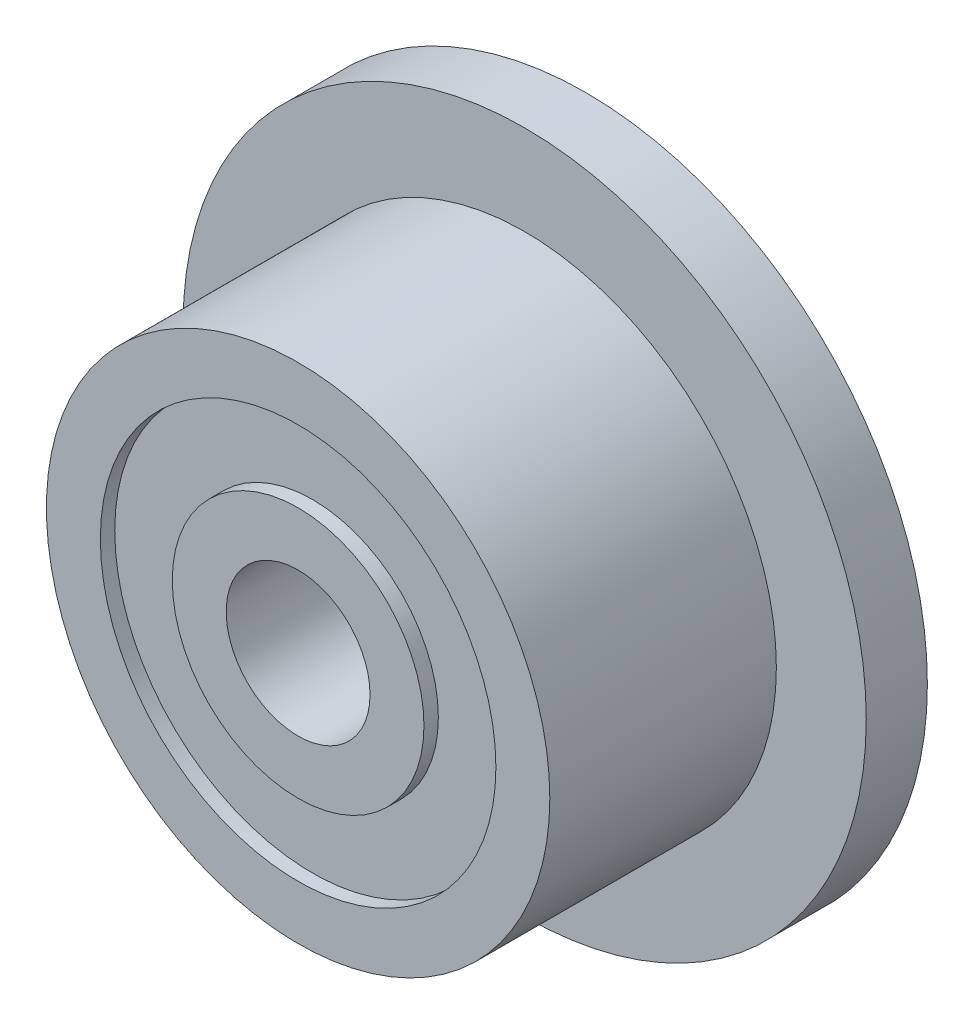
ISO-10303-21;
HEADER;
FILE_DESCRIPTION(('STEP AP214'),'2;1');
FILE_NAME('part.step','',(''),(''),'','','');
FILE_SCHEMA(('AUTOMOTIVE_DESIGN { 1 0 10303 214 1 1 1 1 }'));
ENDSEC;
DATA;
#1=APPLICATION_CONTEXT('core data for automotive mechanical design processes');
#2=APPLICATION_PROTOCOL_DEFINITION('international standard','automotive_design',2000,#1);
#3=PRODUCT_CONTEXT('',#1,'mechanical');
#4=PRODUCT('Part','Part','',(#3));
#5=PRODUCT_RELATED_PRODUCT_CATEGORY('part','',(#4));
#6=PRODUCT_DEFINITION_FORMATION('','',#4);
#7=PRODUCT_DEFINITION_CONTEXT('part definition',#1,'design');
#8=PRODUCT_DEFINITION('design','',#6,#7);
#9=PRODUCT_DEFINITION_SHAPE('','',#8);
#10=(LENGTH_UNIT() NAMED_UNIT(*) SI_UNIT(.MILLI.,.METRE.));
#11=(NAMED_UNIT(*) PLANE_ANGLE_UNIT() SI_UNIT($,.RADIAN.));
#12=(NAMED_UNIT(*) SI_UNIT($,.STERADIAN.) SOLID_ANGLE_UNIT());
#13=UNCERTAINTY_MEASURE_WITH_UNIT(LENGTH_MEASURE(1.E-05),#10,'distance_accuracy_value','');
#14=(GEOMETRIC_REPRESENTATION_CONTEXT(3) GLOBAL_UNCERTAINTY_ASSIGNED_CONTEXT((#13)) GLOBAL_UNIT_ASSIGNED_CONTEXT((#10,
#11,#12)) REPRESENTATION_CONTEXT('',''));
#15=CARTESIAN_POINT('',(0.,0.,0.));
#16=DIRECTION('',(0.,0.,1.));
#17=DIRECTION('',(1.,0.,0.));
#18=AXIS2_PLACEMENT_3D('',#15,#16,#17);
#19=CARTESIAN_POINT('',(0.,0.,0.));
#20=DIRECTION('',(0.,0.,1.));
#21=DIRECTION('',(1.,0.,0.));
#22=AXIS2_PLACEMENT_3D('',#19,#20,#21);
#23=PLANE('',#22);
#24=CARTESIAN_POINT('',(0.,0.,0.));
#25=DIRECTION('',(0.,0.,1.));
#26=DIRECTION('',(1.,0.,0.));
#27=AXIS2_PLACEMENT_3D('',#24,#25,#26);
#28=CIRCLE('',#27,1.);
#29=CARTESIAN_POINT('',(1.,0.,0.));
#30=VERTEX_POINT('',#29);
#31=EDGE_CURVE('E47',#30,#30,#28,.T.);
#32=ORIENTED_EDGE('',*,*,#31,.T.);
#33=EDGE_LOOP('',(#32));
#34=FACE_BOUND('',#33,.T.);
#35=CARTESIAN_POINT('',(0.,0.,0.));
#36=DIRECTION('',(0.,0.,-1.));
#37=DIRECTION('',(-1.,0.,0.));
#38=AXIS2_PLACEMENT_3D('',#35,#36,#37);
#39=CIRCLE('',#38,1.75);
#40=CARTESIAN_POINT('',(-1.75,0.,0.));
#41=VERTEX_POINT('',#40);
#42=EDGE_CURVE('E72',#41,#41,#39,.T.);
#43=ORIENTED_EDGE('',*,*,#42,.T.);
#44=EDGE_LOOP('',(#43));
#45=FACE_BOUND('',#44,.T.);
#46=ADVANCED_FACE('F30',(#34,#45),#23,.F.);
#47=CARTESIAN_POINT('',(0.,0.,4.));
#48=DIRECTION('',(0.,0.,1.));
#49=DIRECTION('',(1.,0.,0.));
#50=AXIS2_PLACEMENT_3D('',#47,#48,#49);
#51=PLANE('',#50);
#52=CARTESIAN_POINT('',(0.,0.,4.));
#53=DIRECTION('',(0.,0.,1.));
#54=DIRECTION('',(1.,0.,0.));
#55=AXIS2_PLACEMENT_3D('',#52,#53,#54);
#56=CIRCLE('',#55,1.);
#57=CARTESIAN_POINT('',(1.,0.,4.));
#58=VERTEX_POINT('',#57);
#59=EDGE_CURVE('E48',#58,#58,#56,.T.);
#60=ORIENTED_EDGE('',*,*,#59,.F.);
#61=EDGE_LOOP('',(#60));
#62=FACE_BOUND('',#61,.T.);
#63=CARTESIAN_POINT('',(0.,0.,4.));
#64=DIRECTION('',(0.,0.,1.));
#65=DIRECTION('',(1.,0.,0.));
#66=AXIS2_PLACEMENT_3D('',#63,#64,#65);
#67=CIRCLE('',#66,1.75);
#68=CARTESIAN_POINT('',(1.75,0.,4.));
#69=VERTEX_POINT('',#68);
#70=EDGE_CURVE('E60',#69,#69,#67,.T.);
#71=ORIENTED_EDGE('',*,*,#70,.T.);
#72=EDGE_LOOP('',(#71));
#73=FACE_BOUND('',#72,.T.);
#74=ADVANCED_FACE('F103',(#62,#73),#51,.T.);
#75=CARTESIAN_POINT('',(0.,0.,0.85));
#76=DIRECTION('',(0.,0.,-1.));
#77=DIRECTION('',(-1.,0.,0.));
#78=AXIS2_PLACEMENT_3D('',#75,#76,#77);
#79=CYLINDRICAL_SURFACE('',#78,4.75);
#80=CARTESIAN_POINT('',(0.,0.,0.85));
#81=DIRECTION('',(0.,0.,1.));
#82=DIRECTION('',(1.,0.,0.));
#83=AXIS2_PLACEMENT_3D('',#80,#81,#82);
#84=CIRCLE('',#83,4.75);
#85=CARTESIAN_POINT('',(4.75,0.,0.85));
#86=VERTEX_POINT('',#85);
#87=EDGE_CURVE('E38',#86,#86,#84,.T.);
#88=ORIENTED_EDGE('',*,*,#87,.F.);
#89=EDGE_LOOP('',(#88));
#90=FACE_BOUND('',#89,.T.);
#91=CARTESIAN_POINT('',(0.,0.,0.));
#92=DIRECTION('',(0.,0.,1.));
#93=DIRECTION('',(1.,0.,0.));
#94=AXIS2_PLACEMENT_3D('',#91,#92,#93);
#95=CIRCLE('',#94,4.75);
#96=CARTESIAN_POINT('',(4.75,0.,0.));
#97=VERTEX_POINT('',#96);
#98=EDGE_CURVE('E34',#97,#97,#95,.T.);
#99=ORIENTED_EDGE('',*,*,#98,.T.);
#100=EDGE_LOOP('',(#99));
#101=FACE_BOUND('',#100,.T.);
#102=ADVANCED_FACE('F32',(#90,#101),#79,.T.);
#103=CARTESIAN_POINT('',(0.,0.,0.85));
#104=DIRECTION('',(0.,0.,1.));
#105=DIRECTION('',(1.,0.,0.));
#106=AXIS2_PLACEMENT_3D('',#103,#104,#105);
#107=PLANE('',#106);
#108=CARTESIAN_POINT('',(0.,0.,0.85));
#109=DIRECTION('',(0.,0.,1.));
#110=DIRECTION('',(1.,0.,0.));
#111=AXIS2_PLACEMENT_3D('',#108,#109,#110);
#112=CIRCLE('',#111,3.5);
#113=CARTESIAN_POINT('',(3.5,0.,0.85));
#114=VERTEX_POINT('',#113);
#115=EDGE_CURVE('E10',#114,#114,#112,.T.);
#116=ORIENTED_EDGE('',*,*,#115,.F.);
#117=EDGE_LOOP('',(#116));
#118=FACE_BOUND('',#117,.T.);
#119=ORIENTED_EDGE('',*,*,#87,.T.);
#120=EDGE_LOOP('',(#119));
#121=FACE_BOUND('',#120,.T.);
#122=ADVANCED_FACE('F98',(#118,#121),#107,.T.);
#123=CARTESIAN_POINT('',(0.,0.,0.));
#124=DIRECTION('',(0.,0.,-1.));
#125=DIRECTION('',(-1.,0.,0.));
#126=AXIS2_PLACEMENT_3D('',#123,#124,#125);
#127=CIRCLE('',#126,2.75);
#128=CARTESIAN_POINT('',(-2.75,0.,0.));
#129=VERTEX_POINT('',#128);
#130=EDGE_CURVE('E66',#129,#129,#127,.T.);
#131=ORIENTED_EDGE('',*,*,#130,.F.);
#132=EDGE_LOOP('',(#131));
#133=FACE_BOUND('',#132,.T.);
#134=ORIENTED_EDGE('',*,*,#98,.F.);
#135=EDGE_LOOP('',(#134));
#136=FACE_BOUND('',#135,.T.);
#137=ADVANCED_FACE('F94',(#133,#136),#23,.F.);
#138=CARTESIAN_POINT('',(0.,0.,4.));
#139=DIRECTION('',(0.,0.,-1.));
#140=DIRECTION('',(-1.,0.,0.));
#141=AXIS2_PLACEMENT_3D('',#138,#139,#140);
#142=CYLINDRICAL_SURFACE('',#141,3.5);
#143=CARTESIAN_POINT('',(0.,0.,4.));
#144=DIRECTION('',(0.,0.,1.));
#145=DIRECTION('',(1.,0.,0.));
#146=AXIS2_PLACEMENT_3D('',#143,#144,#145);
#147=CIRCLE('',#146,3.5);
#148=CARTESIAN_POINT('',(3.5,0.,4.));
#149=VERTEX_POINT('',#148);
#150=EDGE_CURVE('E44',#149,#149,#147,.T.);
#151=ORIENTED_EDGE('',*,*,#150,.F.);
#152=EDGE_LOOP('',(#151));
#153=FACE_BOUND('',#152,.T.);
#154=ORIENTED_EDGE('',*,*,#115,.T.);
#155=EDGE_LOOP('',(#154));
#156=FACE_BOUND('',#155,.T.);
#157=ADVANCED_FACE('F97',(#153,#156),#142,.T.);
#158=CARTESIAN_POINT('',(0.,0.,4.));
#159=DIRECTION('',(0.,0.,1.));
#160=DIRECTION('',(1.,0.,0.));
#161=AXIS2_PLACEMENT_3D('',#158,#159,#160);
#162=CIRCLE('',#161,2.75);
#163=CARTESIAN_POINT('',(2.75,0.,4.));
#164=VERTEX_POINT('',#163);
#165=EDGE_CURVE('E54',#164,#164,#162,.T.);
#166=ORIENTED_EDGE('',*,*,#165,.F.);
#167=EDGE_LOOP('',(#166));
#168=FACE_BOUND('',#167,.T.);
#169=ORIENTED_EDGE('',*,*,#150,.T.);
#170=EDGE_LOOP('',(#169));
#171=FACE_BOUND('',#170,.T.);
#172=ADVANCED_FACE('F113',(#168,#171),#51,.T.);
#173=CARTESIAN_POINT('',(0.,0.,0.));
#174=DIRECTION('',(0.,0.,1.));
#175=DIRECTION('',(1.,0.,0.));
#176=AXIS2_PLACEMENT_3D('',#173,#174,#175);
#177=CYLINDRICAL_SURFACE('',#176,1.);
#178=ORIENTED_EDGE('',*,*,#31,.F.);
#179=EDGE_LOOP('',(#178));
#180=FACE_BOUND('',#179,.T.);
#181=ORIENTED_EDGE('',*,*,#59,.T.);
#182=EDGE_LOOP('',(#181));
#183=FACE_BOUND('',#182,.T.);
#184=ADVANCED_FACE('F125',(#180,#183),#177,.F.);
#185=CARTESIAN_POINT('',(0.,0.,3.8));
#186=DIRECTION('',(0.,0.,1.));
#187=DIRECTION('',(1.,0.,0.));
#188=AXIS2_PLACEMENT_3D('',#185,#186,#187);
#189=CYLINDRICAL_SURFACE('',#188,2.75);
#190=CARTESIAN_POINT('',(0.,0.,3.8));
#191=DIRECTION('',(0.,0.,1.));
#192=DIRECTION('',(1.,0.,0.));
#193=AXIS2_PLACEMENT_3D('',#190,#191,#192);
#194=CIRCLE('',#193,2.75);
#195=CARTESIAN_POINT('',(2.75,0.,3.8));
#196=VERTEX_POINT('',#195);
#197=EDGE_CURVE('E51',#196,#196,#194,.T.);
#198=ORIENTED_EDGE('',*,*,#197,.F.);
#199=EDGE_LOOP('',(#198));
#200=FACE_BOUND('',#199,.T.);
#201=ORIENTED_EDGE('',*,*,#165,.T.);
#202=EDGE_LOOP('',(#201));
#203=FACE_BOUND('',#202,.T.);
#204=ADVANCED_FACE('F129',(#200,#203),#189,.F.);
#205=CARTESIAN_POINT('',(0.,0.,3.8));
#206=DIRECTION('',(0.,0.,1.));
#207=DIRECTION('',(1.,0.,0.));
#208=AXIS2_PLACEMENT_3D('',#205,#206,#207);
#209=PLANE('',#208);
#210=CARTESIAN_POINT('',(0.,0.,3.8));
#211=DIRECTION('',(0.,0.,1.));
#212=DIRECTION('',(1.,0.,0.));
#213=AXIS2_PLACEMENT_3D('',#210,#211,#212);
#214=CIRCLE('',#213,1.75);
#215=CARTESIAN_POINT('',(1.75,0.,3.8));
#216=VERTEX_POINT('',#215);
#217=EDGE_CURVE('E57',#216,#216,#214,.T.);
#218=ORIENTED_EDGE('',*,*,#217,.F.);
#219=EDGE_LOOP('',(#218));
#220=FACE_BOUND('',#219,.T.);
#221=ORIENTED_EDGE('',*,*,#197,.T.);
#222=EDGE_LOOP('',(#221));
#223=FACE_BOUND('',#222,.T.);
#224=ADVANCED_FACE('F133',(#220,#223),#209,.T.);
#225=CARTESIAN_POINT('',(0.,0.,3.8));
#226=DIRECTION('',(0.,0.,1.));
#227=DIRECTION('',(1.,0.,0.));
#228=AXIS2_PLACEMENT_3D('',#225,#226,#227);
#229=CYLINDRICAL_SURFACE('',#228,1.75);
#230=ORIENTED_EDGE('',*,*,#217,.T.);
#231=EDGE_LOOP('',(#230));
#232=FACE_BOUND('',#231,.T.);
#233=ORIENTED_EDGE('',*,*,#70,.F.);
#234=EDGE_LOOP('',(#233));
#235=FACE_BOUND('',#234,.T.);
#236=ADVANCED_FACE('F90',(#232,#235),#229,.T.);
#237=CARTESIAN_POINT('',(0.,0.,0.2));
#238=DIRECTION('',(0.,0.,-1.));
#239=DIRECTION('',(-1.,0.,0.));
#240=AXIS2_PLACEMENT_3D('',#237,#238,#239);
#241=CYLINDRICAL_SURFACE('',#240,2.75);
#242=CARTESIAN_POINT('',(0.,0.,0.2));
#243=DIRECTION('',(0.,0.,-1.));
#244=DIRECTION('',(-1.,0.,0.));
#245=AXIS2_PLACEMENT_3D('',#242,#243,#244);
#246=CIRCLE('',#245,2.75);
#247=CARTESIAN_POINT('',(-2.75,0.,0.2));
#248=VERTEX_POINT('',#247);
#249=EDGE_CURVE('E63',#248,#248,#246,.T.);
#250=ORIENTED_EDGE('',*,*,#249,.F.);
#251=EDGE_LOOP('',(#250));
#252=FACE_BOUND('',#251,.T.);
#253=ORIENTED_EDGE('',*,*,#130,.T.);
#254=EDGE_LOOP('',(#253));
#255=FACE_BOUND('',#254,.T.);
#256=ADVANCED_FACE('F84',(#252,#255),#241,.F.);
#257=CARTESIAN_POINT('',(0.,0.,0.2));
#258=DIRECTION('',(0.,0.,-1.));
#259=DIRECTION('',(-1.,0.,0.));
#260=AXIS2_PLACEMENT_3D('',#257,#258,#259);
#261=PLANE('',#260);
#262=CARTESIAN_POINT('',(0.,0.,0.2));
#263=DIRECTION('',(0.,0.,-1.));
#264=DIRECTION('',(-1.,0.,0.));
#265=AXIS2_PLACEMENT_3D('',#262,#263,#264);
#266=CIRCLE('',#265,1.75);
#267=CARTESIAN_POINT('',(-1.75,0.,0.2));
#268=VERTEX_POINT('',#267);
#269=EDGE_CURVE('E69',#268,#268,#266,.T.);
#270=ORIENTED_EDGE('',*,*,#269,.F.);
#271=EDGE_LOOP('',(#270));
#272=FACE_BOUND('',#271,.T.);
#273=ORIENTED_EDGE('',*,*,#249,.T.);
#274=EDGE_LOOP('',(#273));
#275=FACE_BOUND('',#274,.T.);
#276=ADVANCED_FACE('F81',(#272,#275),#261,.T.);
#277=CARTESIAN_POINT('',(0.,0.,0.2));
#278=DIRECTION('',(0.,0.,-1.));
#279=DIRECTION('',(-1.,0.,0.));
#280=AXIS2_PLACEMENT_3D('',#277,#278,#279);
#281=CYLINDRICAL_SURFACE('',#280,1.75);
#282=ORIENTED_EDGE('',*,*,#269,.T.);
#283=EDGE_LOOP('',(#282));
#284=FACE_BOUND('',#283,.T.);
#285=ORIENTED_EDGE('',*,*,#42,.F.);
#286=EDGE_LOOP('',(#285));
#287=FACE_BOUND('',#286,.T.);
#288=ADVANCED_FACE('F78',(#284,#287),#281,.T.);
#289=CLOSED_SHELL('',(#46,#74,#102,#122,#137,#157,#172,#184,#204,#224,#236,#256,#276,#288));
#290=MANIFOLD_SOLID_BREP('B2',#289);
#291=ADVANCED_BREP_SHAPE_REPRESENTATION('',(#18,#290),#14);
#292=SHAPE_DEFINITION_REPRESENTATION(#9,#291);
ENDSEC;
END-ISO-10303-21;
